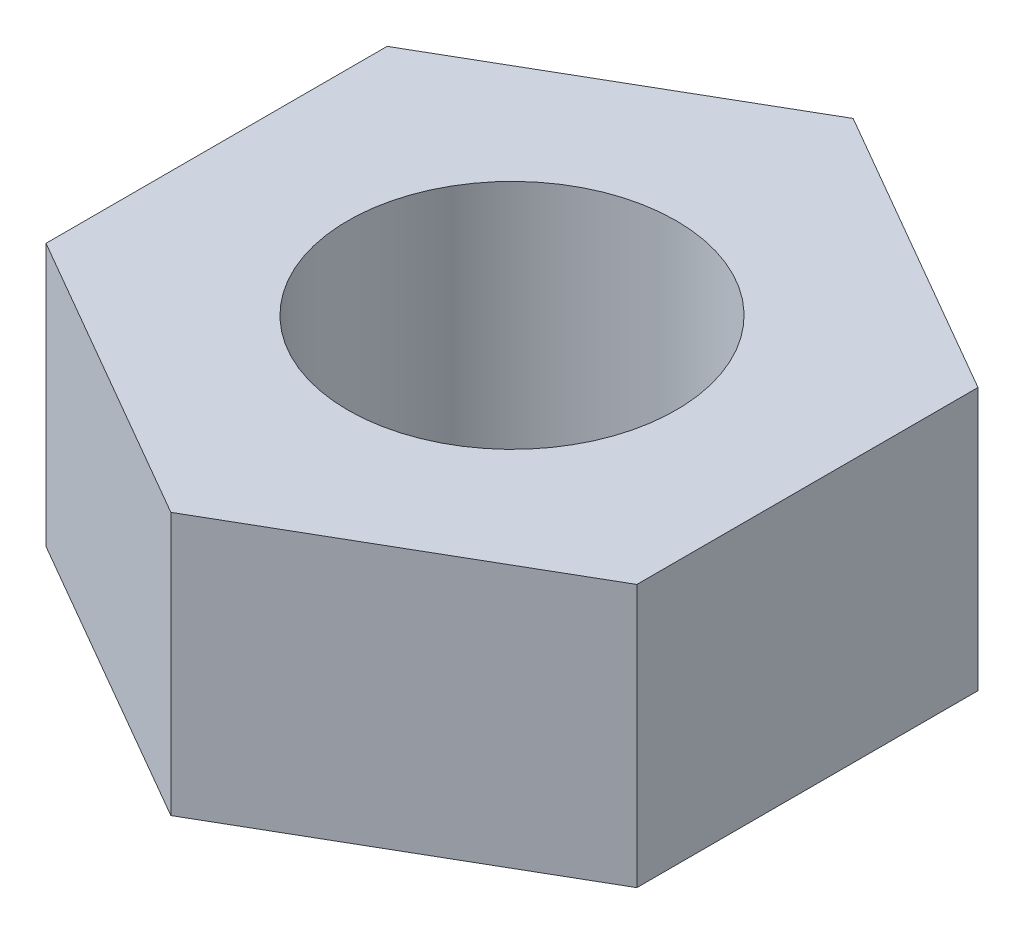
ISO-10303-21;
HEADER;
FILE_DESCRIPTION(('STEP AP214'),'2;1');
FILE_NAME('part.step','',(''),(''),'','','');
FILE_SCHEMA(('AUTOMOTIVE_DESIGN { 1 0 10303 214 1 1 1 1 }'));
ENDSEC;
DATA;
#1=APPLICATION_CONTEXT('core data for automotive mechanical design processes');
#2=APPLICATION_PROTOCOL_DEFINITION('international standard','automotive_design',2000,#1);
#3=PRODUCT_CONTEXT('',#1,'mechanical');
#4=PRODUCT('Part','Part','',(#3));
#5=PRODUCT_RELATED_PRODUCT_CATEGORY('part','',(#4));
#6=PRODUCT_DEFINITION_FORMATION('','',#4);
#7=PRODUCT_DEFINITION_CONTEXT('part definition',#1,'design');
#8=PRODUCT_DEFINITION('design','',#6,#7);
#9=PRODUCT_DEFINITION_SHAPE('','',#8);
#10=(LENGTH_UNIT() NAMED_UNIT(*) SI_UNIT(.MILLI.,.METRE.));
#11=(NAMED_UNIT(*) PLANE_ANGLE_UNIT() SI_UNIT($,.RADIAN.));
#12=(NAMED_UNIT(*) SI_UNIT($,.STERADIAN.) SOLID_ANGLE_UNIT());
#13=UNCERTAINTY_MEASURE_WITH_UNIT(LENGTH_MEASURE(1.E-05),#10,'distance_accuracy_value','');
#14=(GEOMETRIC_REPRESENTATION_CONTEXT(3) GLOBAL_UNCERTAINTY_ASSIGNED_CONTEXT((#13)) GLOBAL_UNIT_ASSIGNED_CONTEXT((#10,
#11,#12)) REPRESENTATION_CONTEXT('',''));
#15=CARTESIAN_POINT('',(0.,0.,0.));
#16=DIRECTION('',(0.,0.,1.));
#17=DIRECTION('',(1.,0.,0.));
#18=AXIS2_PLACEMENT_3D('',#15,#16,#17);
#19=CARTESIAN_POINT('',(2.7,2.4,-1.55884572681199));
#20=DIRECTION('',(-0.5,0.,0.866025403784439));
#21=DIRECTION('',(0.866025403784439,0.,0.5));
#22=AXIS2_PLACEMENT_3D('',#19,#20,#21);
#23=PLANE('',#22);
#24=DIRECTION('',(-0.866025403784439,0.,-0.5));
#25=VECTOR('',#24,1.);
#26=CARTESIAN_POINT('',(2.7,0.,-1.55884572681199));
#27=LINE('',#26,#25);
#28=CARTESIAN_POINT('',(2.7,0.,-1.55884572681199));
#29=VERTEX_POINT('',#28);
#30=CARTESIAN_POINT('',(0.,0.,-3.11769145362398));
#31=VERTEX_POINT('',#30);
#32=EDGE_CURVE('E121',#29,#31,#27,.T.);
#33=ORIENTED_EDGE('',*,*,#32,.T.);
#34=DIRECTION('',(0.,-1.,0.));
#35=VECTOR('',#34,1.);
#36=CARTESIAN_POINT('',(0.,2.4,-3.11769145362398));
#37=LINE('',#36,#35);
#38=CARTESIAN_POINT('',(0.,2.4,-3.11769145362398));
#39=VERTEX_POINT('',#38);
#40=EDGE_CURVE('E11',#39,#31,#37,.T.);
#41=ORIENTED_EDGE('',*,*,#40,.F.);
#42=DIRECTION('',(-0.866025403784439,0.,-0.5));
#43=VECTOR('',#42,1.);
#44=CARTESIAN_POINT('',(2.7,2.4,-1.55884572681199));
#45=LINE('',#44,#43);
#46=CARTESIAN_POINT('',(2.7,2.4,-1.55884572681199));
#47=VERTEX_POINT('',#46);
#48=EDGE_CURVE('E132',#47,#39,#45,.T.);
#49=ORIENTED_EDGE('',*,*,#48,.F.);
#50=DIRECTION('',(0.,-1.,0.));
#51=VECTOR('',#50,1.);
#52=CARTESIAN_POINT('',(2.7,2.4,-1.55884572681199));
#53=LINE('',#52,#51);
#54=EDGE_CURVE('E117',#47,#29,#53,.T.);
#55=ORIENTED_EDGE('',*,*,#54,.T.);
#56=EDGE_LOOP('',(#33,#41,#49,#55));
#57=FACE_BOUND('',#56,.T.);
#58=ADVANCED_FACE('F37',(#57),#23,.F.);
#59=CARTESIAN_POINT('',(0.,2.4,-3.11769145362398));
#60=DIRECTION('',(0.5,0.,0.866025403784439));
#61=DIRECTION('',(0.866025403784439,0.,-0.5));
#62=AXIS2_PLACEMENT_3D('',#59,#60,#61);
#63=PLANE('',#62);
#64=DIRECTION('',(-0.866025403784439,0.,0.5));
#65=VECTOR('',#64,1.);
#66=CARTESIAN_POINT('',(0.,0.,-3.11769145362398));
#67=LINE('',#66,#65);
#68=CARTESIAN_POINT('',(-2.7,0.,-1.55884572681199));
#69=VERTEX_POINT('',#68);
#70=EDGE_CURVE('E124',#31,#69,#67,.T.);
#71=ORIENTED_EDGE('',*,*,#70,.T.);
#72=DIRECTION('',(0.,-1.,0.));
#73=VECTOR('',#72,1.);
#74=CARTESIAN_POINT('',(-2.7,2.4,-1.55884572681199));
#75=LINE('',#74,#73);
#76=CARTESIAN_POINT('',(-2.7,2.4,-1.55884572681199));
#77=VERTEX_POINT('',#76);
#78=EDGE_CURVE('E45',#77,#69,#75,.T.);
#79=ORIENTED_EDGE('',*,*,#78,.F.);
#80=DIRECTION('',(-0.866025403784439,0.,0.5));
#81=VECTOR('',#80,1.);
#82=CARTESIAN_POINT('',(0.,2.4,-3.11769145362398));
#83=LINE('',#82,#81);
#84=EDGE_CURVE('E90',#39,#77,#83,.T.);
#85=ORIENTED_EDGE('',*,*,#84,.F.);
#86=ORIENTED_EDGE('',*,*,#40,.T.);
#87=EDGE_LOOP('',(#71,#79,#85,#86));
#88=FACE_BOUND('',#87,.T.);
#89=ADVANCED_FACE('F157',(#88),#63,.F.);
#90=CARTESIAN_POINT('',(-2.7,2.4,-1.55884572681199));
#91=DIRECTION('',(1.,0.,0.));
#92=DIRECTION('',(0.,0.,-1.));
#93=AXIS2_PLACEMENT_3D('',#90,#91,#92);
#94=PLANE('',#93);
#95=DIRECTION('',(0.,0.,1.));
#96=VECTOR('',#95,1.);
#97=CARTESIAN_POINT('',(-2.7,0.,-1.55884572681199));
#98=LINE('',#97,#96);
#99=CARTESIAN_POINT('',(-2.7,0.,1.55884572681199));
#100=VERTEX_POINT('',#99);
#101=EDGE_CURVE('E127',#69,#100,#98,.T.);
#102=ORIENTED_EDGE('',*,*,#101,.T.);
#103=DIRECTION('',(0.,-1.,0.));
#104=VECTOR('',#103,1.);
#105=CARTESIAN_POINT('',(-2.7,2.4,1.55884572681199));
#106=LINE('',#105,#104);
#107=CARTESIAN_POINT('',(-2.7,2.4,1.55884572681199));
#108=VERTEX_POINT('',#107);
#109=EDGE_CURVE('E112',#108,#100,#106,.T.);
#110=ORIENTED_EDGE('',*,*,#109,.F.);
#111=DIRECTION('',(0.,0.,1.));
#112=VECTOR('',#111,1.);
#113=CARTESIAN_POINT('',(-2.7,2.4,-1.55884572681199));
#114=LINE('',#113,#112);
#115=EDGE_CURVE('E103',#77,#108,#114,.T.);
#116=ORIENTED_EDGE('',*,*,#115,.F.);
#117=ORIENTED_EDGE('',*,*,#78,.T.);
#118=EDGE_LOOP('',(#102,#110,#116,#117));
#119=FACE_BOUND('',#118,.T.);
#120=ADVANCED_FACE('F138',(#119),#94,.F.);
#121=CARTESIAN_POINT('',(-2.7,2.4,1.55884572681199));
#122=DIRECTION('',(0.5,0.,-0.866025403784439));
#123=DIRECTION('',(-0.866025403784439,0.,-0.5));
#124=AXIS2_PLACEMENT_3D('',#121,#122,#123);
#125=PLANE('',#124);
#126=DIRECTION('',(0.866025403784439,0.,0.5));
#127=VECTOR('',#126,1.);
#128=CARTESIAN_POINT('',(-2.7,0.,1.55884572681199));
#129=LINE('',#128,#127);
#130=CARTESIAN_POINT('',(0.,0.,3.11769145362398));
#131=VERTEX_POINT('',#130);
#132=EDGE_CURVE('E111',#100,#131,#129,.T.);
#133=ORIENTED_EDGE('',*,*,#132,.T.);
#134=DIRECTION('',(0.,-1.,0.));
#135=VECTOR('',#134,1.);
#136=CARTESIAN_POINT('',(0.,2.4,3.11769145362398));
#137=LINE('',#136,#135);
#138=CARTESIAN_POINT('',(0.,2.4,3.11769145362398));
#139=VERTEX_POINT('',#138);
#140=EDGE_CURVE('E108',#139,#131,#137,.T.);
#141=ORIENTED_EDGE('',*,*,#140,.F.);
#142=DIRECTION('',(0.866025403784439,0.,0.5));
#143=VECTOR('',#142,1.);
#144=CARTESIAN_POINT('',(-2.7,2.4,1.55884572681199));
#145=LINE('',#144,#143);
#146=EDGE_CURVE('E97',#108,#139,#145,.T.);
#147=ORIENTED_EDGE('',*,*,#146,.F.);
#148=ORIENTED_EDGE('',*,*,#109,.T.);
#149=EDGE_LOOP('',(#133,#141,#147,#148));
#150=FACE_BOUND('',#149,.T.);
#151=ADVANCED_FACE('F109',(#150),#125,.F.);
#152=CARTESIAN_POINT('',(0.,2.4,3.11769145362398));
#153=DIRECTION('',(-0.5,0.,-0.866025403784439));
#154=DIRECTION('',(-0.866025403784439,0.,0.5));
#155=AXIS2_PLACEMENT_3D('',#152,#153,#154);
#156=PLANE('',#155);
#157=DIRECTION('',(0.866025403784439,0.,-0.5));
#158=VECTOR('',#157,1.);
#159=CARTESIAN_POINT('',(0.,0.,3.11769145362398));
#160=LINE('',#159,#158);
#161=CARTESIAN_POINT('',(2.7,0.,1.55884572681198));
#162=VERTEX_POINT('',#161);
#163=EDGE_CURVE('E76',#131,#162,#160,.T.);
#164=ORIENTED_EDGE('',*,*,#163,.T.);
#165=DIRECTION('',(0.,-1.,0.));
#166=VECTOR('',#165,1.);
#167=CARTESIAN_POINT('',(2.7,2.4,1.55884572681198));
#168=LINE('',#167,#166);
#169=CARTESIAN_POINT('',(2.7,2.4,1.55884572681198));
#170=VERTEX_POINT('',#169);
#171=EDGE_CURVE('E113',#170,#162,#168,.T.);
#172=ORIENTED_EDGE('',*,*,#171,.F.);
#173=DIRECTION('',(0.866025403784439,0.,-0.5));
#174=VECTOR('',#173,1.);
#175=CARTESIAN_POINT('',(0.,2.4,3.11769145362398));
#176=LINE('',#175,#174);
#177=EDGE_CURVE('E101',#139,#170,#176,.T.);
#178=ORIENTED_EDGE('',*,*,#177,.F.);
#179=ORIENTED_EDGE('',*,*,#140,.T.);
#180=EDGE_LOOP('',(#164,#172,#178,#179));
#181=FACE_BOUND('',#180,.T.);
#182=ADVANCED_FACE('F115',(#181),#156,.F.);
#183=CARTESIAN_POINT('',(2.7,2.4,1.55884572681198));
#184=DIRECTION('',(-1.,0.,0.));
#185=DIRECTION('',(0.,0.,1.));
#186=AXIS2_PLACEMENT_3D('',#183,#184,#185);
#187=PLANE('',#186);
#188=DIRECTION('',(0.,0.,-1.));
#189=VECTOR('',#188,1.);
#190=CARTESIAN_POINT('',(2.7,0.,1.55884572681198));
#191=LINE('',#190,#189);
#192=EDGE_CURVE('E82',#162,#29,#191,.T.);
#193=ORIENTED_EDGE('',*,*,#192,.T.);
#194=ORIENTED_EDGE('',*,*,#54,.F.);
#195=DIRECTION('',(0.,0.,-1.));
#196=VECTOR('',#195,1.);
#197=CARTESIAN_POINT('',(2.7,2.4,1.55884572681198));
#198=LINE('',#197,#196);
#199=EDGE_CURVE('E53',#170,#47,#198,.T.);
#200=ORIENTED_EDGE('',*,*,#199,.F.);
#201=ORIENTED_EDGE('',*,*,#171,.T.);
#202=EDGE_LOOP('',(#193,#194,#200,#201));
#203=FACE_BOUND('',#202,.T.);
#204=ADVANCED_FACE('F145',(#203),#187,.F.);
#205=CARTESIAN_POINT('',(0.,2.4,0.));
#206=DIRECTION('',(0.,1.,0.));
#207=DIRECTION('',(0.,0.,1.));
#208=AXIS2_PLACEMENT_3D('',#205,#206,#207);
#209=PLANE('',#208);
#210=CARTESIAN_POINT('',(0.,2.4,0.));
#211=DIRECTION('',(0.,1.,0.));
#212=DIRECTION('',(0.,0.,1.));
#213=AXIS2_PLACEMENT_3D('',#210,#211,#212);
#214=CIRCLE('',#213,1.5);
#215=CARTESIAN_POINT('',(0.,2.4,1.5));
#216=VERTEX_POINT('',#215);
#217=EDGE_CURVE('E244',#216,#216,#214,.T.);
#218=ORIENTED_EDGE('',*,*,#217,.F.);
#219=EDGE_LOOP('',(#218));
#220=FACE_BOUND('',#219,.T.);
#221=ORIENTED_EDGE('',*,*,#48,.T.);
#222=ORIENTED_EDGE('',*,*,#84,.T.);
#223=ORIENTED_EDGE('',*,*,#115,.T.);
#224=ORIENTED_EDGE('',*,*,#146,.T.);
#225=ORIENTED_EDGE('',*,*,#177,.T.);
#226=ORIENTED_EDGE('',*,*,#199,.T.);
#227=EDGE_LOOP('',(#221,#222,#223,#224,#225,#226));
#228=FACE_BOUND('',#227,.T.);
#229=ADVANCED_FACE('F99',(#220,#228),#209,.T.);
#230=CARTESIAN_POINT('',(0.,0.,0.));
#231=DIRECTION('',(0.,1.,0.));
#232=DIRECTION('',(0.,0.,1.));
#233=AXIS2_PLACEMENT_3D('',#230,#231,#232);
#234=PLANE('',#233);
#235=CARTESIAN_POINT('',(0.,0.,0.));
#236=DIRECTION('',(0.,1.,0.));
#237=DIRECTION('',(0.,0.,1.));
#238=AXIS2_PLACEMENT_3D('',#235,#236,#237);
#239=CIRCLE('',#238,1.5);
#240=CARTESIAN_POINT('',(0.,0.,1.5));
#241=VERTEX_POINT('',#240);
#242=EDGE_CURVE('E125',#241,#241,#239,.T.);
#243=ORIENTED_EDGE('',*,*,#242,.T.);
#244=EDGE_LOOP('',(#243));
#245=FACE_BOUND('',#244,.T.);
#246=ORIENTED_EDGE('',*,*,#32,.F.);
#247=ORIENTED_EDGE('',*,*,#192,.F.);
#248=ORIENTED_EDGE('',*,*,#163,.F.);
#249=ORIENTED_EDGE('',*,*,#132,.F.);
#250=ORIENTED_EDGE('',*,*,#101,.F.);
#251=ORIENTED_EDGE('',*,*,#70,.F.);
#252=EDGE_LOOP('',(#246,#247,#248,#249,#250,#251));
#253=FACE_BOUND('',#252,.T.);
#254=ADVANCED_FACE('F141',(#245,#253),#234,.F.);
#255=CARTESIAN_POINT('',(0.,0.,0.));
#256=DIRECTION('',(0.,1.,0.));
#257=DIRECTION('',(0.,0.,1.));
#258=AXIS2_PLACEMENT_3D('',#255,#256,#257);
#259=CYLINDRICAL_SURFACE('',#258,1.5);
#260=ORIENTED_EDGE('',*,*,#242,.F.);
#261=EDGE_LOOP('',(#260));
#262=FACE_BOUND('',#261,.T.);
#263=ORIENTED_EDGE('',*,*,#217,.T.);
#264=EDGE_LOOP('',(#263));
#265=FACE_BOUND('',#264,.T.);
#266=ADVANCED_FACE('F197',(#262,#265),#259,.F.);
#267=CLOSED_SHELL('',(#58,#89,#120,#151,#182,#204,#229,#254,#266));
#268=MANIFOLD_SOLID_BREP('B2',#267);
#269=ADVANCED_BREP_SHAPE_REPRESENTATION('',(#18,#268),#14);
#270=SHAPE_DEFINITION_REPRESENTATION(#9,#269);
ENDSEC;
END-ISO-10303-21;
